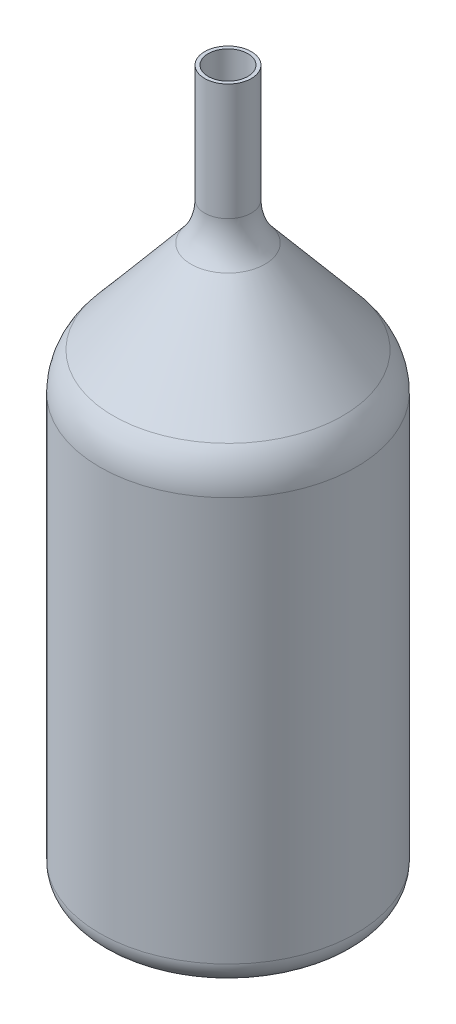
ISO-10303-21;
HEADER;
FILE_DESCRIPTION(('STEP AP214'),'2;1');
FILE_NAME('part.step','',(''),(''),'','','');
FILE_SCHEMA(('AUTOMOTIVE_DESIGN { 1 0 10303 214 1 1 1 1 }'));
ENDSEC;
DATA;
#1=APPLICATION_CONTEXT('core data for automotive mechanical design processes');
#2=APPLICATION_PROTOCOL_DEFINITION('international standard','automotive_design',2000,#1);
#3=PRODUCT_CONTEXT('',#1,'mechanical');
#4=PRODUCT('Part','Part','',(#3));
#5=PRODUCT_RELATED_PRODUCT_CATEGORY('part','',(#4));
#6=PRODUCT_DEFINITION_FORMATION('','',#4);
#7=PRODUCT_DEFINITION_CONTEXT('part definition',#1,'design');
#8=PRODUCT_DEFINITION('design','',#6,#7);
#9=PRODUCT_DEFINITION_SHAPE('','',#8);
#10=(LENGTH_UNIT() NAMED_UNIT(*) SI_UNIT(.MILLI.,.METRE.));
#11=(NAMED_UNIT(*) PLANE_ANGLE_UNIT() SI_UNIT($,.RADIAN.));
#12=(NAMED_UNIT(*) SI_UNIT($,.STERADIAN.) SOLID_ANGLE_UNIT());
#13=UNCERTAINTY_MEASURE_WITH_UNIT(LENGTH_MEASURE(1.E-05),#10,'distance_accuracy_value','');
#14=(GEOMETRIC_REPRESENTATION_CONTEXT(3) GLOBAL_UNCERTAINTY_ASSIGNED_CONTEXT((#13)) GLOBAL_UNIT_ASSIGNED_CONTEXT((#10,
#11,#12)) REPRESENTATION_CONTEXT('',''));
#15=CARTESIAN_POINT('',(0.,0.,0.));
#16=DIRECTION('',(0.,0.,1.));
#17=DIRECTION('',(1.,0.,0.));
#18=AXIS2_PLACEMENT_3D('',#15,#16,#17);
#19=CARTESIAN_POINT('',(0.,0.,0.));
#20=DIRECTION('',(0.,-1.,0.));
#21=DIRECTION('',(0.,0.,-1.));
#22=AXIS2_PLACEMENT_3D('',#19,#20,#21);
#23=CYLINDRICAL_SURFACE('',#22,8.5);
#24=CARTESIAN_POINT('',(0.,255.,0.));
#25=DIRECTION('',(0.,-1.,0.));
#26=DIRECTION('',(0.,0.,-1.));
#27=AXIS2_PLACEMENT_3D('',#24,#25,#26);
#28=CIRCLE('',#27,8.5);
#29=CARTESIAN_POINT('',(0.,255.,-8.5));
#30=VERTEX_POINT('',#29);
#31=EDGE_CURVE('E96',#30,#30,#28,.T.);
#32=ORIENTED_EDGE('',*,*,#31,.T.);
#33=EDGE_LOOP('',(#32));
#34=FACE_BOUND('',#33,.T.);
#35=CARTESIAN_POINT('',(0.,305.,0.));
#36=DIRECTION('',(0.,-1.,0.));
#37=DIRECTION('',(0.,0.,-1.));
#38=AXIS2_PLACEMENT_3D('',#35,#36,#37);
#39=CIRCLE('',#38,8.5);
#40=CARTESIAN_POINT('',(0.,305.,-8.5));
#41=VERTEX_POINT('',#40);
#42=EDGE_CURVE('E10',#41,#41,#39,.T.);
#43=ORIENTED_EDGE('',*,*,#42,.F.);
#44=EDGE_LOOP('',(#43));
#45=FACE_BOUND('',#44,.T.);
#46=ADVANCED_FACE('F37',(#34,#45),#23,.F.);
#47=CARTESIAN_POINT('',(-10.,305.,0.));
#48=DIRECTION('',(0.,1.,0.));
#49=DIRECTION('',(0.,0.,1.));
#50=AXIS2_PLACEMENT_3D('',#47,#48,#49);
#51=PLANE('',#50);
#52=ORIENTED_EDGE('',*,*,#42,.T.);
#53=EDGE_LOOP('',(#52));
#54=FACE_BOUND('',#53,.T.);
#55=CARTESIAN_POINT('',(0.,305.,0.));
#56=DIRECTION('',(0.,-1.,0.));
#57=DIRECTION('',(0.,0.,-1.));
#58=AXIS2_PLACEMENT_3D('',#55,#56,#57);
#59=CIRCLE('',#58,10.);
#60=CARTESIAN_POINT('',(0.,305.,-10.));
#61=VERTEX_POINT('',#60);
#62=EDGE_CURVE('E44',#61,#61,#59,.T.);
#63=ORIENTED_EDGE('',*,*,#62,.F.);
#64=EDGE_LOOP('',(#63));
#65=FACE_BOUND('',#64,.T.);
#66=ADVANCED_FACE('F144',(#54,#65),#51,.T.);
#67=CARTESIAN_POINT('',(0.,0.,0.));
#68=DIRECTION('',(0.,-1.,0.));
#69=DIRECTION('',(0.,0.,-1.));
#70=AXIS2_PLACEMENT_3D('',#67,#68,#69);
#71=CYLINDRICAL_SURFACE('',#70,10.);
#72=ORIENTED_EDGE('',*,*,#62,.T.);
#73=EDGE_LOOP('',(#72));
#74=FACE_BOUND('',#73,.T.);
#75=CARTESIAN_POINT('',(0.,255.,0.));
#76=DIRECTION('',(0.,-1.,0.));
#77=DIRECTION('',(0.,0.,-1.));
#78=AXIS2_PLACEMENT_3D('',#75,#76,#77);
#79=CIRCLE('',#78,10.);
#80=CARTESIAN_POINT('',(0.,255.,-10.));
#81=VERTEX_POINT('',#80);
#82=EDGE_CURVE('E49',#81,#81,#79,.T.);
#83=ORIENTED_EDGE('',*,*,#82,.F.);
#84=EDGE_LOOP('',(#83));
#85=FACE_BOUND('',#84,.T.);
#86=ADVANCED_FACE('F148',(#74,#85),#71,.T.);
#87=CARTESIAN_POINT('',(0.,255.,0.));
#88=DIRECTION('',(0.,-1.,0.));
#89=DIRECTION('',(0.,0.,-1.));
#90=AXIS2_PLACEMENT_3D('',#87,#88,#89);
#91=TOROIDAL_SURFACE('',#90,35.,25.);
#92=ORIENTED_EDGE('',*,*,#82,.T.);
#93=EDGE_LOOP('',(#92));
#94=FACE_BOUND('',#93,.T.);
#95=CARTESIAN_POINT('',(0.,238.930309757837,0.));
#96=DIRECTION('',(0.,-1.,0.));
#97=DIRECTION('',(0.,0.,-1.));
#98=AXIS2_PLACEMENT_3D('',#95,#96,#97);
#99=CIRCLE('',#98,15.8488889220256);
#100=CARTESIAN_POINT('',(0.,238.930309757837,-15.8488889220256));
#101=VERTEX_POINT('',#100);
#102=EDGE_CURVE('E54',#101,#101,#99,.T.);
#103=ORIENTED_EDGE('',*,*,#102,.F.);
#104=EDGE_LOOP('',(#103));
#105=FACE_BOUND('',#104,.T.);
#106=ADVANCED_FACE('F152',(#94,#105),#91,.F.);
#107=CARTESIAN_POINT('',(0.,199.242266862114,0.));
#108=DIRECTION('',(0.,-1.,0.));
#109=DIRECTION('',(0.,0.,-1.));
#110=AXIS2_PLACEMENT_3D('',#107,#108,#109);
#111=CONICAL_SURFACE('',#110,49.1511110779744,0.698131700797733);
#112=CARTESIAN_POINT('',(0.,199.242266862114,0.));
#113=DIRECTION('',(0.,-1.,0.));
#114=DIRECTION('',(0.,0.,-1.));
#115=AXIS2_PLACEMENT_3D('',#112,#113,#114);
#116=CIRCLE('',#115,49.1511110779744);
#117=CARTESIAN_POINT('',(0.,199.242266862114,-49.1511110779744));
#118=VERTEX_POINT('',#117);
#119=EDGE_CURVE('E60',#118,#118,#116,.T.);
#120=CARTESIAN_POINT('',(0.,238.930309757837,-15.8488889220256));
#121=CARTESIAN_POINT('',(0.,238.516892644339,-16.1957870694834));
#122=CARTESIAN_POINT('',(0.,238.103475530842,-16.5426852169412));
#123=CARTESIAN_POINT('',(0.,237.276641303848,-17.2364815118568));
#124=CARTESIAN_POINT('',(0.,236.863224190351,-17.5833796593146));
#125=CARTESIAN_POINT('',(0.,236.036389963357,-18.2771759542302));
#126=CARTESIAN_POINT('',(0.,235.62297284986,-18.624074101688));
#127=CARTESIAN_POINT('',(0.,234.796138622865,-19.3178703966036));
#128=CARTESIAN_POINT('',(0.,234.382721509368,-19.6647685440614));
#129=CARTESIAN_POINT('',(0.,233.555887282374,-20.358564838977));
#130=CARTESIAN_POINT('',(0.,233.142470168877,-20.7054629864348));
#131=CARTESIAN_POINT('',(0.,232.315635941883,-21.3992592813504));
#132=CARTESIAN_POINT('',(0.,231.902218828386,-21.7461574288082));
#133=CARTESIAN_POINT('',(0.,231.075384601391,-22.4399537237238));
#134=CARTESIAN_POINT('',(0.,230.661967487894,-22.7868518711816));
#135=CARTESIAN_POINT('',(0.,229.8351332609,-23.4806481660972));
#136=CARTESIAN_POINT('',(0.,229.421716147403,-23.827546313555));
#137=CARTESIAN_POINT('',(0.,228.594881920409,-24.5213426084706));
#138=CARTESIAN_POINT('',(0.,228.181464806912,-24.8682407559284));
#139=CARTESIAN_POINT('',(0.,227.354630579918,-25.562037050844));
#140=CARTESIAN_POINT('',(0.,226.94121346642,-25.9089351983018));
#141=CARTESIAN_POINT('',(0.,226.114379239426,-26.6027314932174));
#142=CARTESIAN_POINT('',(0.,225.700962125929,-26.9496296406752));
#143=CARTESIAN_POINT('',(0.,224.874127898935,-27.6434259355908));
#144=CARTESIAN_POINT('',(0.,224.460710785438,-27.9903240830486));
#145=CARTESIAN_POINT('',(0.,223.633876558444,-28.6841203779642));
#146=CARTESIAN_POINT('',(0.,223.220459444946,-29.031018525422));
#147=CARTESIAN_POINT('',(0.,222.393625217952,-29.7248148203376));
#148=CARTESIAN_POINT('',(0.,221.980208104455,-30.0717129677954));
#149=CARTESIAN_POINT('',(0.,221.153373877461,-30.765509262711));
#150=CARTESIAN_POINT('',(0.,220.739956763964,-31.1124074101688));
#151=CARTESIAN_POINT('',(0.,219.91312253697,-31.8062037050844));
#152=CARTESIAN_POINT('',(0.,219.499705423472,-32.1531018525422));
#153=CARTESIAN_POINT('',(0.,218.672871196478,-32.8468981474578));
#154=CARTESIAN_POINT('',(0.,218.259454082981,-33.1937962949156));
#155=CARTESIAN_POINT('',(0.,217.432619855987,-33.8875925898312));
#156=CARTESIAN_POINT('',(0.,217.01920274249,-34.234490737289));
#157=CARTESIAN_POINT('',(0.,216.192368515496,-34.9282870322046));
#158=CARTESIAN_POINT('',(0.,215.778951401998,-35.2751851796624));
#159=CARTESIAN_POINT('',(0.,214.952117175004,-35.968981474578));
#160=CARTESIAN_POINT('',(0.,214.538700061507,-36.3158796220358));
#161=CARTESIAN_POINT('',(0.,213.711865834513,-37.0096759169514));
#162=CARTESIAN_POINT('',(0.,213.298448721016,-37.3565740644092));
#163=CARTESIAN_POINT('',(0.,212.471614494022,-38.0503703593248));
#164=CARTESIAN_POINT('',(0.,212.058197380524,-38.3972685067826));
#165=CARTESIAN_POINT('',(0.,211.23136315353,-39.0910648016982));
#166=CARTESIAN_POINT('',(0.,210.817946040033,-39.437962949156));
#167=CARTESIAN_POINT('',(0.,209.991111813039,-40.1317592440716));
#168=CARTESIAN_POINT('',(0.,209.577694699542,-40.4786573915294));
#169=CARTESIAN_POINT('',(0.,208.750860472548,-41.172453686445));
#170=CARTESIAN_POINT('',(0.,208.33744335905,-41.5193518339028));
#171=CARTESIAN_POINT('',(0.,207.510609132056,-42.2131481288184));
#172=CARTESIAN_POINT('',(0.,207.097192018559,-42.5600462762762));
#173=CARTESIAN_POINT('',(0.,206.270357791565,-43.2538425711918));
#174=CARTESIAN_POINT('',(0.,205.856940678068,-43.6007407186496));
#175=CARTESIAN_POINT('',(0.,205.030106451074,-44.2945370135652));
#176=CARTESIAN_POINT('',(0.,204.616689337577,-44.641435161023));
#177=CARTESIAN_POINT('',(0.,203.789855110582,-45.3352314559386));
#178=CARTESIAN_POINT('',(0.,203.376437997085,-45.6821296033964));
#179=CARTESIAN_POINT('',(0.,202.549603770091,-46.375925898312));
#180=CARTESIAN_POINT('',(0.,202.136186656594,-46.7228240457698));
#181=CARTESIAN_POINT('',(0.,201.3093524296,-47.4166203406854));
#182=CARTESIAN_POINT('',(0.,200.895935316103,-47.7635184881432));
#183=CARTESIAN_POINT('',(0.,200.069101089108,-48.4573147830588));
#184=CARTESIAN_POINT('',(0.,199.655683975611,-48.8042129305166));
#185=CARTESIAN_POINT('',(0.,199.242266862114,-49.1511110779744));
#186=B_SPLINE_CURVE_WITH_KNOTS('',3,(#120,#121,#122,#123,#124,#125,#126,#127,#128,#129,#130,
#131,#132,#133,#134,#135,#136,#137,#138,#139,#140,#141,#142,#143,#144,#145,#146,#147,#148,#149,
#150,#151,#152,#153,#154,#155,#156,#157,#158,#159,#160,#161,#162,#163,#164,#165,#166,#167,#168,
#169,#170,#171,#172,#173,#174,#175,#176,#177,#178,#179,#180,#181,#182,#183,#184,#185),
.UNSPECIFIED.,.F.,.F.,(4,2,2,2,2,2,2,2,2,2,2,2,2,2,2,2,2,2,2,2,2,2,2,2,2,2,2,2,2,2,2,2,4),(0.,
1.61903314048151,3.23806628096302,4.8570994214445,6.47613256192601,8.09516570240752,
9.71419884288903,11.3332319833705,12.952265123852,14.5712982643336,16.1903314048151,
17.8093645452966,19.4283976857781,21.0474308262596,22.6664639667411,24.2854971072226,
25.9045302477041,27.5235633881856,29.1425965286671,30.7616296691486,32.3806628096301,
33.9996959501116,35.6187290905932,37.2377622310747,38.8567953715562,40.4758285120377,
42.0948616525192,43.7138947930007,45.3329279334822,46.9519610739637,48.5709942144452,
50.1900273549267,51.8090604954082),.UNSPECIFIED.);
#187=EDGE_CURVE('BSEAM158',#101,#118,#186,.T.);
#188=ORIENTED_EDGE('',*,*,#102,.T.);
#189=ORIENTED_EDGE('',*,*,#119,.F.);
#190=ORIENTED_EDGE('',*,*,#187,.T.);
#191=ORIENTED_EDGE('',*,*,#187,.F.);
#192=EDGE_LOOP('',(#188,#190,#189,#191));
#193=FACE_BOUND('',#192,.T.);
#194=ADVANCED_FACE('F158',(#193),#111,.T.);
#195=CARTESIAN_POINT('',(0.,183.172576619951,0.));
#196=DIRECTION('',(0.,-1.,0.));
#197=DIRECTION('',(0.,0.,-1.));
#198=AXIS2_PLACEMENT_3D('',#195,#196,#197);
#199=TOROIDAL_SURFACE('',#198,30.,25.);
#200=ORIENTED_EDGE('',*,*,#119,.T.);
#201=EDGE_LOOP('',(#200));
#202=FACE_BOUND('',#201,.T.);
#203=CARTESIAN_POINT('',(0.,183.172576619951,0.));
#204=DIRECTION('',(0.,-1.,0.));
#205=DIRECTION('',(0.,0.,-1.));
#206=AXIS2_PLACEMENT_3D('',#203,#204,#205);
#207=CIRCLE('',#206,55.);
#208=CARTESIAN_POINT('',(0.,183.172576619951,-55.));
#209=VERTEX_POINT('',#208);
#210=EDGE_CURVE('E64',#209,#209,#207,.T.);
#211=ORIENTED_EDGE('',*,*,#210,.F.);
#212=EDGE_LOOP('',(#211));
#213=FACE_BOUND('',#212,.T.);
#214=ADVANCED_FACE('F162',(#202,#213),#199,.T.);
#215=CARTESIAN_POINT('',(0.,0.,0.));
#216=DIRECTION('',(0.,-1.,0.));
#217=DIRECTION('',(0.,0.,-1.));
#218=AXIS2_PLACEMENT_3D('',#215,#216,#217);
#219=CYLINDRICAL_SURFACE('',#218,55.);
#220=ORIENTED_EDGE('',*,*,#210,.T.);
#221=EDGE_LOOP('',(#220));
#222=FACE_BOUND('',#221,.T.);
#223=CARTESIAN_POINT('',(0.,9.99999999999999,0.));
#224=DIRECTION('',(0.,-1.,0.));
#225=DIRECTION('',(0.,0.,-1.));
#226=AXIS2_PLACEMENT_3D('',#223,#224,#225);
#227=CIRCLE('',#226,55.);
#228=CARTESIAN_POINT('',(0.,9.99999999999999,-55.));
#229=VERTEX_POINT('',#228);
#230=EDGE_CURVE('E68',#229,#229,#227,.T.);
#231=ORIENTED_EDGE('',*,*,#230,.F.);
#232=EDGE_LOOP('',(#231));
#233=FACE_BOUND('',#232,.T.);
#234=ADVANCED_FACE('F166',(#222,#233),#219,.T.);
#235=CARTESIAN_POINT('',(0.,9.99999999999999,0.));
#236=DIRECTION('',(0.,-1.,0.));
#237=DIRECTION('',(0.,0.,-1.));
#238=AXIS2_PLACEMENT_3D('',#235,#236,#237);
#239=TOROIDAL_SURFACE('',#238,45.,10.);
#240=ORIENTED_EDGE('',*,*,#230,.T.);
#241=EDGE_LOOP('',(#240));
#242=FACE_BOUND('',#241,.T.);
#243=CARTESIAN_POINT('',(0.,0.,0.));
#244=DIRECTION('',(0.,-1.,0.));
#245=DIRECTION('',(0.,0.,-1.));
#246=AXIS2_PLACEMENT_3D('',#243,#244,#245);
#247=CIRCLE('',#246,45.);
#248=CARTESIAN_POINT('',(0.,0.,-45.));
#249=VERTEX_POINT('',#248);
#250=EDGE_CURVE('E72',#249,#249,#247,.T.);
#251=ORIENTED_EDGE('',*,*,#250,.F.);
#252=EDGE_LOOP('',(#251));
#253=FACE_BOUND('',#252,.T.);
#254=ADVANCED_FACE('F140',(#242,#253),#239,.T.);
#255=CARTESIAN_POINT('',(0.,0.,0.));
#256=DIRECTION('',(0.,-1.,0.));
#257=DIRECTION('',(0.,0.,-1.));
#258=AXIS2_PLACEMENT_3D('',#255,#256,#257);
#259=PLANE('',#258);
#260=ORIENTED_EDGE('',*,*,#250,.T.);
#261=EDGE_LOOP('',(#260));
#262=FACE_BOUND('',#261,.T.);
#263=ADVANCED_FACE('F135',(#262),#259,.T.);
#264=CARTESIAN_POINT('',(0.,1.5,0.));
#265=DIRECTION('',(0.,-1.,0.));
#266=DIRECTION('',(0.,0.,-1.));
#267=AXIS2_PLACEMENT_3D('',#264,#265,#266);
#268=PLANE('',#267);
#269=CARTESIAN_POINT('',(0.,1.5,0.));
#270=DIRECTION('',(0.,-1.,0.));
#271=DIRECTION('',(0.,0.,-1.));
#272=AXIS2_PLACEMENT_3D('',#269,#270,#271);
#273=CIRCLE('',#272,45.);
#274=CARTESIAN_POINT('',(0.,1.5,-45.));
#275=VERTEX_POINT('',#274);
#276=EDGE_CURVE('E76',#275,#275,#273,.T.);
#277=ORIENTED_EDGE('',*,*,#276,.F.);
#278=EDGE_LOOP('',(#277));
#279=FACE_BOUND('',#278,.T.);
#280=ADVANCED_FACE('F130',(#279),#268,.F.);
#281=CARTESIAN_POINT('',(0.,9.99999999999999,0.));
#282=DIRECTION('',(0.,-1.,0.));
#283=DIRECTION('',(0.,0.,-1.));
#284=AXIS2_PLACEMENT_3D('',#281,#282,#283);
#285=TOROIDAL_SURFACE('',#284,45.,8.5);
#286=CARTESIAN_POINT('',(0.,9.99999999999999,0.));
#287=DIRECTION('',(0.,-1.,0.));
#288=DIRECTION('',(0.,0.,-1.));
#289=AXIS2_PLACEMENT_3D('',#286,#287,#288);
#290=CIRCLE('',#289,53.5);
#291=CARTESIAN_POINT('',(0.,9.99999999999999,-53.5));
#292=VERTEX_POINT('',#291);
#293=EDGE_CURVE('E80',#292,#292,#290,.T.);
#294=ORIENTED_EDGE('',*,*,#293,.F.);
#295=EDGE_LOOP('',(#294));
#296=FACE_BOUND('',#295,.T.);
#297=ORIENTED_EDGE('',*,*,#276,.T.);
#298=EDGE_LOOP('',(#297));
#299=FACE_BOUND('',#298,.T.);
#300=ADVANCED_FACE('F124',(#296,#299),#285,.F.);
#301=CARTESIAN_POINT('',(0.,0.,0.));
#302=DIRECTION('',(0.,-1.,0.));
#303=DIRECTION('',(0.,0.,-1.));
#304=AXIS2_PLACEMENT_3D('',#301,#302,#303);
#305=CYLINDRICAL_SURFACE('',#304,53.5);
#306=CARTESIAN_POINT('',(0.,183.172576619951,0.));
#307=DIRECTION('',(0.,-1.,0.));
#308=DIRECTION('',(0.,0.,-1.));
#309=AXIS2_PLACEMENT_3D('',#306,#307,#308);
#310=CIRCLE('',#309,53.5);
#311=CARTESIAN_POINT('',(0.,183.172576619951,-53.5));
#312=VERTEX_POINT('',#311);
#313=EDGE_CURVE('E84',#312,#312,#310,.T.);
#314=ORIENTED_EDGE('',*,*,#313,.F.);
#315=EDGE_LOOP('',(#314));
#316=FACE_BOUND('',#315,.T.);
#317=ORIENTED_EDGE('',*,*,#293,.T.);
#318=EDGE_LOOP('',(#317));
#319=FACE_BOUND('',#318,.T.);
#320=ADVANCED_FACE('F118',(#316,#319),#305,.F.);
#321=CARTESIAN_POINT('',(0.,183.172576619951,0.));
#322=DIRECTION('',(0.,-1.,0.));
#323=DIRECTION('',(0.,0.,-1.));
#324=AXIS2_PLACEMENT_3D('',#321,#322,#323);
#325=TOROIDAL_SURFACE('',#324,30.,23.5);
#326=CARTESIAN_POINT('',(0.,198.278085447584,0.));
#327=DIRECTION('',(0.,-1.,0.));
#328=DIRECTION('',(0.,0.,-1.));
#329=AXIS2_PLACEMENT_3D('',#326,#327,#328);
#330=CIRCLE('',#329,48.002044413296);
#331=CARTESIAN_POINT('',(0.,198.278085447584,-48.002044413296));
#332=VERTEX_POINT('',#331);
#333=EDGE_CURVE('E88',#332,#332,#330,.T.);
#334=ORIENTED_EDGE('',*,*,#333,.F.);
#335=EDGE_LOOP('',(#334));
#336=FACE_BOUND('',#335,.T.);
#337=ORIENTED_EDGE('',*,*,#313,.T.);
#338=EDGE_LOOP('',(#337));
#339=FACE_BOUND('',#338,.T.);
#340=ADVANCED_FACE('F112',(#336,#339),#325,.F.);
#341=CARTESIAN_POINT('',(0.,198.278085447584,0.));
#342=DIRECTION('',(0.,-1.,0.));
#343=DIRECTION('',(0.,0.,-1.));
#344=AXIS2_PLACEMENT_3D('',#341,#342,#343);
#345=CONICAL_SURFACE('',#344,48.002044413296,0.698131700797733);
#346=CARTESIAN_POINT('',(0.,237.966128343307,0.));
#347=DIRECTION('',(0.,-1.,0.));
#348=DIRECTION('',(0.,0.,-1.));
#349=AXIS2_PLACEMENT_3D('',#346,#347,#348);
#350=CIRCLE('',#349,14.6998222573471);
#351=CARTESIAN_POINT('',(0.,237.966128343307,-14.6998222573471));
#352=VERTEX_POINT('',#351);
#353=EDGE_CURVE('E92',#352,#352,#350,.T.);
#354=CARTESIAN_POINT('',(0.,237.966128343307,-14.6998222573471));
#355=CARTESIAN_POINT('',(0.,237.55271122981,-15.0467204048049));
#356=CARTESIAN_POINT('',(0.,237.139294116312,-15.3936185522627));
#357=CARTESIAN_POINT('',(0.,236.312459889318,-16.0874148471783));
#358=CARTESIAN_POINT('',(0.,235.899042775821,-16.4343129946361));
#359=CARTESIAN_POINT('',(0.,235.072208548827,-17.1281092895517));
#360=CARTESIAN_POINT('',(0.,234.65879143533,-17.4750074370095));
#361=CARTESIAN_POINT('',(0.,233.831957208336,-18.1688037319251));
#362=CARTESIAN_POINT('',(0.,233.418540094839,-18.5157018793829));
#363=CARTESIAN_POINT('',(0.,232.591705867844,-19.2094981742985));
#364=CARTESIAN_POINT('',(0.,232.178288754347,-19.5563963217563));
#365=CARTESIAN_POINT('',(0.,231.351454527353,-20.2501926166719));
#366=CARTESIAN_POINT('',(0.,230.938037413856,-20.5970907641297));
#367=CARTESIAN_POINT('',(0.,230.111203186862,-21.2908870590453));
#368=CARTESIAN_POINT('',(0.,229.697786073365,-21.6377852065031));
#369=CARTESIAN_POINT('',(0.,228.87095184637,-22.3315815014187));
#370=CARTESIAN_POINT('',(0.,228.457534732873,-22.6784796488765));
#371=CARTESIAN_POINT('',(0.,227.630700505879,-23.3722759437921));
#372=CARTESIAN_POINT('',(0.,227.217283392382,-23.7191740912499));
#373=CARTESIAN_POINT('',(0.,226.390449165388,-24.4129703861655));
#374=CARTESIAN_POINT('',(0.,225.977032051891,-24.7598685336233));
#375=CARTESIAN_POINT('',(0.,225.150197824896,-25.4536648285389));
#376=CARTESIAN_POINT('',(0.,224.736780711399,-25.8005629759967));
#377=CARTESIAN_POINT('',(0.,223.909946484405,-26.4943592709123));
#378=CARTESIAN_POINT('',(0.,223.496529370908,-26.8412574183701));
#379=CARTESIAN_POINT('',(0.,222.669695143914,-27.5350537132857));
#380=CARTESIAN_POINT('',(0.,222.256278030417,-27.8819518607435));
#381=CARTESIAN_POINT('',(0.,221.429443803422,-28.5757481556591));
#382=CARTESIAN_POINT('',(0.,221.016026689925,-28.9226463031169));
#383=CARTESIAN_POINT('',(0.,220.189192462931,-29.6164425980325));
#384=CARTESIAN_POINT('',(0.,219.775775349434,-29.9633407454903));
#385=CARTESIAN_POINT('',(0.,218.94894112244,-30.6571370404059));
#386=CARTESIAN_POINT('',(0.,218.535524008943,-31.0040351878637));
#387=CARTESIAN_POINT('',(0.,217.708689781948,-31.6978314827793));
#388=CARTESIAN_POINT('',(0.,217.295272668451,-32.0447296302371));
#389=CARTESIAN_POINT('',(0.,216.468438441457,-32.7385259251527));
#390=CARTESIAN_POINT('',(0.,216.05502132796,-33.0854240726105));
#391=CARTESIAN_POINT('',(0.,215.228187100966,-33.7792203675261));
#392=CARTESIAN_POINT('',(0.,214.814769987469,-34.1261185149839));
#393=CARTESIAN_POINT('',(0.,213.987935760474,-34.8199148098995));
#394=CARTESIAN_POINT('',(0.,213.574518646977,-35.1668129573573));
#395=CARTESIAN_POINT('',(0.,212.747684419983,-35.8606092522729));
#396=CARTESIAN_POINT('',(0.,212.334267306486,-36.2075073997307));
#397=CARTESIAN_POINT('',(0.,211.507433079492,-36.9013036946463));
#398=CARTESIAN_POINT('',(0.,211.094015965995,-37.2482018421041));
#399=CARTESIAN_POINT('',(0.,210.267181739,-37.9419981370197));
#400=CARTESIAN_POINT('',(0.,209.853764625503,-38.2888962844775));
#401=CARTESIAN_POINT('',(0.,209.026930398509,-38.9826925793931));
#402=CARTESIAN_POINT('',(0.,208.613513285012,-39.3295907268509));
#403=CARTESIAN_POINT('',(0.,207.786679058018,-40.0233870217665));
#404=CARTESIAN_POINT('',(0.,207.373261944521,-40.3702851692243));
#405=CARTESIAN_POINT('',(0.,206.546427717526,-41.0640814641399));
#406=CARTESIAN_POINT('',(0.,206.133010604029,-41.4109796115977));
#407=CARTESIAN_POINT('',(0.,205.306176377035,-42.1047759065133));
#408=CARTESIAN_POINT('',(0.,204.892759263538,-42.4516740539711));
#409=CARTESIAN_POINT('',(0.,204.065925036544,-43.1454703488868));
#410=CARTESIAN_POINT('',(0.,203.652507923047,-43.4923684963445));
#411=CARTESIAN_POINT('',(0.,202.825673696053,-44.1861647912601));
#412=CARTESIAN_POINT('',(0.,202.412256582555,-44.5330629387179));
#413=CARTESIAN_POINT('',(0.,201.585422355561,-45.2268592336336));
#414=CARTESIAN_POINT('',(0.,201.172005242064,-45.5737573810913));
#415=CARTESIAN_POINT('',(0.,200.34517101507,-46.2675536760069));
#416=CARTESIAN_POINT('',(0.,199.931753901573,-46.6144518234647));
#417=CARTESIAN_POINT('',(0.,199.104919674579,-47.3082481183803));
#418=CARTESIAN_POINT('',(0.,198.691502561081,-47.6551462658382));
#419=CARTESIAN_POINT('',(0.,198.278085447584,-48.002044413296));
#420=B_SPLINE_CURVE_WITH_KNOTS('',3,(#354,#355,#356,#357,#358,#359,#360,#361,#362,#363,#364,
#365,#366,#367,#368,#369,#370,#371,#372,#373,#374,#375,#376,#377,#378,#379,#380,#381,#382,#383,
#384,#385,#386,#387,#388,#389,#390,#391,#392,#393,#394,#395,#396,#397,#398,#399,#400,#401,#402,
#403,#404,#405,#406,#407,#408,#409,#410,#411,#412,#413,#414,#415,#416,#417,#418,#419),
.UNSPECIFIED.,.F.,.F.,(4,2,2,2,2,2,2,2,2,2,2,2,2,2,2,2,2,2,2,2,2,2,2,2,2,2,2,2,2,2,2,2,4),(0.,
1.61903314048151,3.23806628096302,4.85709942144451,6.47613256192602,8.09516570240753,
9.71419884288903,11.3332319833705,12.9522651238521,14.5712982643336,16.1903314048151,
17.8093645452966,19.4283976857781,21.0474308262596,22.6664639667411,24.2854971072226,
25.9045302477041,27.5235633881856,29.1425965286671,30.7616296691486,32.3806628096301,
33.9996959501117,35.6187290905932,37.2377622310747,38.8567953715562,40.4758285120377,
42.0948616525192,43.7138947930007,45.3329279334822,46.9519610739637,48.5709942144452,
50.1900273549267,51.8090604954082),.UNSPECIFIED.);
#421=EDGE_CURVE('BSEAM106',#352,#332,#420,.T.);
#422=ORIENTED_EDGE('',*,*,#353,.F.);
#423=ORIENTED_EDGE('',*,*,#333,.T.);
#424=ORIENTED_EDGE('',*,*,#421,.T.);
#425=ORIENTED_EDGE('',*,*,#421,.F.);
#426=EDGE_LOOP('',(#422,#424,#423,#425));
#427=FACE_BOUND('',#426,.T.);
#428=ADVANCED_FACE('F106',(#427),#345,.F.);
#429=CARTESIAN_POINT('',(0.,255.,0.));
#430=DIRECTION('',(0.,-1.,0.));
#431=DIRECTION('',(0.,0.,-1.));
#432=AXIS2_PLACEMENT_3D('',#429,#430,#431);
#433=TOROIDAL_SURFACE('',#432,35.,26.5);
#434=ORIENTED_EDGE('',*,*,#31,.F.);
#435=EDGE_LOOP('',(#434));
#436=FACE_BOUND('',#435,.T.);
#437=ORIENTED_EDGE('',*,*,#353,.T.);
#438=EDGE_LOOP('',(#437));
#439=FACE_BOUND('',#438,.T.);
#440=ADVANCED_FACE('F103',(#436,#439),#433,.T.);
#441=CLOSED_SHELL('',(#46,#66,#86,#106,#194,#214,#234,#254,#263,#280,#300,#320,#340,#428,#440));
#442=MANIFOLD_SOLID_BREP('B2',#441);
#443=ADVANCED_BREP_SHAPE_REPRESENTATION('',(#18,#442),#14);
#444=SHAPE_DEFINITION_REPRESENTATION(#9,#443);
ENDSEC;
END-ISO-10303-21;
